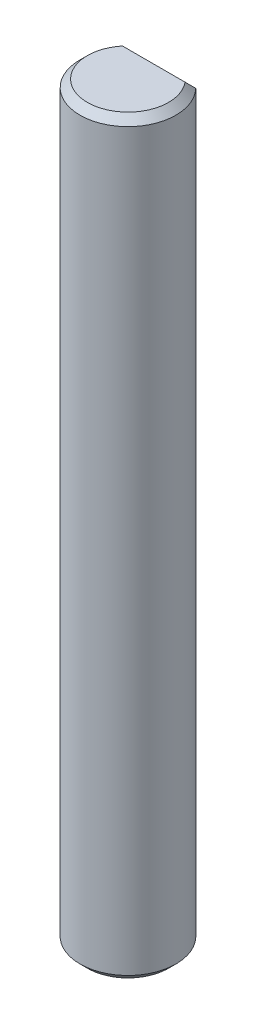
ISO-10303-21;
HEADER;
FILE_DESCRIPTION(('STEP AP214'),'2;1');
FILE_NAME('part.step','',(''),(''),'','','');
FILE_SCHEMA(('AUTOMOTIVE_DESIGN { 1 0 10303 214 1 1 1 1 }'));
ENDSEC;
DATA;
#1=APPLICATION_CONTEXT('core data for automotive mechanical design processes');
#2=APPLICATION_PROTOCOL_DEFINITION('international standard','automotive_design',2000,#1);
#3=PRODUCT_CONTEXT('',#1,'mechanical');
#4=PRODUCT('Part','Part','',(#3));
#5=PRODUCT_RELATED_PRODUCT_CATEGORY('part','',(#4));
#6=PRODUCT_DEFINITION_FORMATION('','',#4);
#7=PRODUCT_DEFINITION_CONTEXT('part definition',#1,'design');
#8=PRODUCT_DEFINITION('design','',#6,#7);
#9=PRODUCT_DEFINITION_SHAPE('','',#8);
#10=(LENGTH_UNIT() NAMED_UNIT(*) SI_UNIT(.MILLI.,.METRE.));
#11=(NAMED_UNIT(*) PLANE_ANGLE_UNIT() SI_UNIT($,.RADIAN.));
#12=(NAMED_UNIT(*) SI_UNIT($,.STERADIAN.) SOLID_ANGLE_UNIT());
#13=UNCERTAINTY_MEASURE_WITH_UNIT(LENGTH_MEASURE(1.E-05),#10,'distance_accuracy_value','');
#14=(GEOMETRIC_REPRESENTATION_CONTEXT(3) GLOBAL_UNCERTAINTY_ASSIGNED_CONTEXT((#13)) GLOBAL_UNIT_ASSIGNED_CONTEXT((#10,
#11,#12)) REPRESENTATION_CONTEXT('',''));
#15=CARTESIAN_POINT('',(0.,0.,0.));
#16=DIRECTION('',(0.,0.,1.));
#17=DIRECTION('',(1.,0.,0.));
#18=AXIS2_PLACEMENT_3D('',#15,#16,#17);
#19=CARTESIAN_POINT('',(0.,25.4,0.));
#20=DIRECTION('',(0.,-1.,0.));
#21=DIRECTION('',(0.,0.,-1.));
#22=AXIS2_PLACEMENT_3D('',#19,#20,#21);
#23=CYLINDRICAL_SURFACE('',#22,3.25);
#24=DIRECTION('',(0.,-1.,0.));
#25=VECTOR('',#24,1.);
#26=CARTESIAN_POINT('',(-2.34520787991172,25.4,-2.25));
#27=LINE('',#26,#25);
#28=CARTESIAN_POINT('',(-2.34520787991172,24.9,-2.25));
#29=VERTEX_POINT('',#28);
#30=CARTESIAN_POINT('',(-2.34520787991172,-24.9,-2.25));
#31=VERTEX_POINT('',#30);
#32=EDGE_CURVE('E91',#29,#31,#27,.T.);
#33=ORIENTED_EDGE('',*,*,#32,.T.);
#34=CARTESIAN_POINT('',(0.,-24.9,0.));
#35=DIRECTION('',(0.,1.,0.));
#36=DIRECTION('',(0.,0.,1.));
#37=AXIS2_PLACEMENT_3D('',#34,#35,#36);
#38=CIRCLE('',#37,3.25);
#39=CARTESIAN_POINT('',(2.34520787991172,-24.9,-2.25));
#40=VERTEX_POINT('',#39);
#41=EDGE_CURVE('E97',#31,#40,#38,.T.);
#42=ORIENTED_EDGE('',*,*,#41,.T.);
#43=DIRECTION('',(0.,-1.,0.));
#44=VECTOR('',#43,1.);
#45=CARTESIAN_POINT('',(2.34520787991172,25.4,-2.25));
#46=LINE('',#45,#44);
#47=CARTESIAN_POINT('',(2.34520787991172,24.9,-2.25));
#48=VERTEX_POINT('',#47);
#49=EDGE_CURVE('E93',#48,#40,#46,.T.);
#50=ORIENTED_EDGE('',*,*,#49,.F.);
#51=CARTESIAN_POINT('',(0.,24.9,0.));
#52=DIRECTION('',(0.,1.,0.));
#53=DIRECTION('',(0.,0.,1.));
#54=AXIS2_PLACEMENT_3D('',#51,#52,#53);
#55=CIRCLE('',#54,3.25);
#56=EDGE_CURVE('E89',#48,#29,#55,.F.);
#57=ORIENTED_EDGE('',*,*,#56,.T.);
#58=EDGE_LOOP('',(#33,#42,#50,#57));
#59=FACE_BOUND('',#58,.T.);
#60=ADVANCED_FACE('F39',(#59),#23,.T.);
#61=CARTESIAN_POINT('',(-2.34520787991172,25.4,-2.25));
#62=DIRECTION('',(0.,0.,1.));
#63=DIRECTION('',(1.,0.,0.));
#64=AXIS2_PLACEMENT_3D('',#61,#62,#63);
#65=PLANE('',#64);
#66=ORIENTED_EDGE('',*,*,#49,.T.);
#67=DIRECTION('',(-1.,0.,0.));
#68=VECTOR('',#67,1.);
#69=CARTESIAN_POINT('',(-2.34520787991172,-24.9,-2.25));
#70=LINE('',#69,#68);
#71=EDGE_CURVE('E105',#40,#31,#70,.T.);
#72=ORIENTED_EDGE('',*,*,#71,.T.);
#73=ORIENTED_EDGE('',*,*,#32,.F.);
#74=DIRECTION('',(1.,0.,0.));
#75=VECTOR('',#74,1.);
#76=CARTESIAN_POINT('',(2.34520787991172,24.9,-2.25));
#77=LINE('',#76,#75);
#78=EDGE_CURVE('E103',#29,#48,#77,.T.);
#79=ORIENTED_EDGE('',*,*,#78,.T.);
#80=EDGE_LOOP('',(#66,#72,#73,#79));
#81=FACE_BOUND('',#80,.T.);
#82=ADVANCED_FACE('F102',(#81),#65,.F.);
#83=CARTESIAN_POINT('',(0.,25.4,0.));
#84=DIRECTION('',(0.,1.,0.));
#85=DIRECTION('',(0.,0.,1.));
#86=AXIS2_PLACEMENT_3D('',#83,#84,#85);
#87=PLANE('',#86);
#88=CARTESIAN_POINT('',(0.,25.4,0.));
#89=DIRECTION('',(0.,1.,0.));
#90=DIRECTION('',(0.,0.,1.));
#91=AXIS2_PLACEMENT_3D('',#88,#89,#90);
#92=CIRCLE('',#91,2.75);
#93=CARTESIAN_POINT('',(-2.12132034355965,25.4,-1.75));
#94=VERTEX_POINT('',#93);
#95=CARTESIAN_POINT('',(2.12132034355965,25.4,-1.75));
#96=VERTEX_POINT('',#95);
#97=EDGE_CURVE('E54',#94,#96,#92,.T.);
#98=ORIENTED_EDGE('',*,*,#97,.T.);
#99=DIRECTION('',(-1.,0.,0.));
#100=VECTOR('',#99,1.);
#101=CARTESIAN_POINT('',(-2.34520787991172,25.4,-1.75));
#102=LINE('',#101,#100);
#103=EDGE_CURVE('E11',#96,#94,#102,.T.);
#104=ORIENTED_EDGE('',*,*,#103,.T.);
#105=EDGE_LOOP('',(#98,#104));
#106=FACE_BOUND('',#105,.T.);
#107=ADVANCED_FACE('F167',(#106),#87,.T.);
#108=CARTESIAN_POINT('',(0.,-25.4,0.));
#109=DIRECTION('',(0.,1.,0.));
#110=DIRECTION('',(0.,0.,1.));
#111=AXIS2_PLACEMENT_3D('',#108,#109,#110);
#112=PLANE('',#111);
#113=CARTESIAN_POINT('',(0.,-25.4,0.));
#114=DIRECTION('',(0.,1.,0.));
#115=DIRECTION('',(0.,0.,1.));
#116=AXIS2_PLACEMENT_3D('',#113,#114,#115);
#117=CIRCLE('',#116,2.75);
#118=CARTESIAN_POINT('',(2.12132034355964,-25.4,-1.74999999999999));
#119=VERTEX_POINT('',#118);
#120=CARTESIAN_POINT('',(-2.12132034355964,-25.4,-1.74999999999999));
#121=VERTEX_POINT('',#120);
#122=EDGE_CURVE('E151',#119,#121,#117,.F.);
#123=ORIENTED_EDGE('',*,*,#122,.T.);
#124=DIRECTION('',(1.,0.,0.));
#125=VECTOR('',#124,1.);
#126=CARTESIAN_POINT('',(0.,-25.4,-1.74999999999999));
#127=LINE('',#126,#125);
#128=EDGE_CURVE('E98',#121,#119,#127,.T.);
#129=ORIENTED_EDGE('',*,*,#128,.T.);
#130=EDGE_LOOP('',(#123,#129));
#131=FACE_BOUND('',#130,.T.);
#132=ADVANCED_FACE('F165',(#131),#112,.F.);
#133=CARTESIAN_POINT('',(0.,-24.9,0.));
#134=DIRECTION('',(0.,1.,0.));
#135=DIRECTION('',(0.,0.,1.));
#136=AXIS2_PLACEMENT_3D('',#133,#134,#135);
#137=CONICAL_SURFACE('',#136,3.25,0.785398163397452);
#138=CARTESIAN_POINT('',(-2.34520787991172,-24.9,-2.25));
#139=CARTESIAN_POINT('',(-2.3273638426593,-24.9418468402449,-2.2081531597551));
#140=CARTESIAN_POINT('',(-2.30933396054444,-24.983654194641,-2.16634580535902));
#141=CARTESIAN_POINT('',(-2.27287766335211,-25.0671799650697,-2.0828200349303));
#142=CARTESIAN_POINT('',(-2.25445126894054,-25.1088983856135,-2.04110161438645));
#143=CARTESIAN_POINT('',(-2.21717505911824,-25.1922411099403,-1.95775889005964));
#144=CARTESIAN_POINT('',(-2.19832523928832,-25.233865412736,-1.91613458726397));
#145=CARTESIAN_POINT('',(-2.16017106135106,-25.3170120879343,-1.83298791206569));
#146=CARTESIAN_POINT('',(-2.14086667965296,-25.3585344549226,-1.79146554507735));
#147=CARTESIAN_POINT('',(-2.12132034355964,-25.4,-1.74999999999999));
#148=B_SPLINE_CURVE_WITH_KNOTS('',3,(#138,#139,#140,#141,#142,#143,#144,#145,#146,#147),
.UNSPECIFIED.,.F.,.F.,(4,2,2,2,4),(0.,0.18543602010277,0.370862398725451,0.556290713500747,
0.741728672899098),.UNSPECIFIED.);
#149=EDGE_CURVE('E114',#121,#31,#148,.F.);
#150=ORIENTED_EDGE('',*,*,#149,.F.);
#151=ORIENTED_EDGE('',*,*,#122,.F.);
#152=CARTESIAN_POINT('',(2.12132034355964,-25.4,-1.74999999999999));
#153=CARTESIAN_POINT('',(2.14086667965296,-25.3585344549226,-1.79146554507735));
#154=CARTESIAN_POINT('',(2.16017106135106,-25.3170120879343,-1.83298791206569));
#155=CARTESIAN_POINT('',(2.19832523928832,-25.233865412736,-1.91613458726397));
#156=CARTESIAN_POINT('',(2.21717505911824,-25.1922411099403,-1.95775889005964));
#157=CARTESIAN_POINT('',(2.25445126894054,-25.1088983856135,-2.04110161438645));
#158=CARTESIAN_POINT('',(2.27287766335211,-25.0671799650697,-2.08282003493029));
#159=CARTESIAN_POINT('',(2.30933396054444,-24.983654194641,-2.16634580535902));
#160=CARTESIAN_POINT('',(2.3273638426593,-24.9418468402449,-2.2081531597551));
#161=CARTESIAN_POINT('',(2.34520787991172,-24.9,-2.25));
#162=B_SPLINE_CURVE_WITH_KNOTS('',3,(#152,#153,#154,#155,#156,#157,#158,#159,#160,#161),
.UNSPECIFIED.,.F.,.F.,(4,2,2,2,4),(0.,0.185437959398352,0.370866274173646,0.55629265279632,
0.741728672899096),.UNSPECIFIED.);
#163=EDGE_CURVE('E107',#40,#119,#162,.F.);
#164=ORIENTED_EDGE('',*,*,#163,.F.);
#165=ORIENTED_EDGE('',*,*,#41,.F.);
#166=EDGE_LOOP('',(#150,#151,#164,#165));
#167=FACE_BOUND('',#166,.T.);
#168=ADVANCED_FACE('F133',(#167),#137,.T.);
#169=CARTESIAN_POINT('',(-2.34520787991172,-24.9,-2.25));
#170=DIRECTION('',(0.,0.70710678118655,0.707106781186545));
#171=DIRECTION('',(-1.,0.,0.));
#172=AXIS2_PLACEMENT_3D('',#169,#170,#171);
#173=PLANE('',#172);
#174=ORIENTED_EDGE('',*,*,#163,.T.);
#175=ORIENTED_EDGE('',*,*,#128,.F.);
#176=ORIENTED_EDGE('',*,*,#149,.T.);
#177=ORIENTED_EDGE('',*,*,#71,.F.);
#178=EDGE_LOOP('',(#174,#175,#176,#177));
#179=FACE_BOUND('',#178,.T.);
#180=ADVANCED_FACE('F129',(#179),#173,.F.);
#181=CARTESIAN_POINT('',(0.,25.4,0.));
#182=DIRECTION('',(0.,-1.,0.));
#183=DIRECTION('',(0.,0.,-1.));
#184=AXIS2_PLACEMENT_3D('',#181,#182,#183);
#185=CONICAL_SURFACE('',#184,2.75,0.785398163397453);
#186=CARTESIAN_POINT('',(-2.12132034355965,25.4,-1.75));
#187=CARTESIAN_POINT('',(-2.14086667965297,25.3585344549226,-1.79146554507736));
#188=CARTESIAN_POINT('',(-2.16017106135106,25.3170120879343,-1.83298791206569));
#189=CARTESIAN_POINT('',(-2.19832523928832,25.233865412736,-1.91613458726398));
#190=CARTESIAN_POINT('',(-2.21717505911824,25.1922411099404,-1.95775889005965));
#191=CARTESIAN_POINT('',(-2.25445126894054,25.1088983856136,-2.04110161438645));
#192=CARTESIAN_POINT('',(-2.27287766335211,25.0671799650697,-2.0828200349303));
#193=CARTESIAN_POINT('',(-2.30933396054444,24.983654194641,-2.16634580535902));
#194=CARTESIAN_POINT('',(-2.3273638426593,24.9418468402449,-2.2081531597551));
#195=CARTESIAN_POINT('',(-2.34520787991172,24.9,-2.25));
#196=B_SPLINE_CURVE_WITH_KNOTS('',3,(#186,#187,#188,#189,#190,#191,#192,#193,#194,#195),
.UNSPECIFIED.,.F.,.F.,(4,2,2,2,4),(0.,0.185437959398348,0.370866274173641,0.556292652796321,
0.741728672899086),.UNSPECIFIED.);
#197=EDGE_CURVE('E67',#29,#94,#196,.F.);
#198=ORIENTED_EDGE('',*,*,#197,.F.);
#199=ORIENTED_EDGE('',*,*,#56,.F.);
#200=CARTESIAN_POINT('',(2.34520787991172,24.9,-2.25));
#201=CARTESIAN_POINT('',(2.3273638426593,24.9418468402449,-2.2081531597551));
#202=CARTESIAN_POINT('',(2.30933396054444,24.983654194641,-2.16634580535902));
#203=CARTESIAN_POINT('',(2.27287766335211,25.0671799650697,-2.0828200349303));
#204=CARTESIAN_POINT('',(2.25445126894054,25.1088983856136,-2.04110161438645));
#205=CARTESIAN_POINT('',(2.21717505911824,25.1922411099404,-1.95775889005965));
#206=CARTESIAN_POINT('',(2.19832523928832,25.233865412736,-1.91613458726398));
#207=CARTESIAN_POINT('',(2.16017106135106,25.3170120879343,-1.83298791206569));
#208=CARTESIAN_POINT('',(2.14086667965297,25.3585344549226,-1.79146554507736));
#209=CARTESIAN_POINT('',(2.12132034355964,25.4,-1.75));
#210=B_SPLINE_CURVE_WITH_KNOTS('',3,(#200,#201,#202,#203,#204,#205,#206,#207,#208,#209),
.UNSPECIFIED.,.F.,.F.,(4,2,2,2,4),(0.,0.18543602010277,0.370862398725446,0.556290713500739,
0.741728672899088),.UNSPECIFIED.);
#211=EDGE_CURVE('E44',#96,#48,#210,.F.);
#212=ORIENTED_EDGE('',*,*,#211,.F.);
#213=ORIENTED_EDGE('',*,*,#97,.F.);
#214=EDGE_LOOP('',(#198,#199,#212,#213));
#215=FACE_BOUND('',#214,.T.);
#216=ADVANCED_FACE('F111',(#215),#185,.T.);
#217=CARTESIAN_POINT('',(0.,25.4,-1.75));
#218=DIRECTION('',(0.,0.707106781186551,-0.707106781186544));
#219=DIRECTION('',(1.,0.,0.));
#220=AXIS2_PLACEMENT_3D('',#217,#218,#219);
#221=PLANE('',#220);
#222=ORIENTED_EDGE('',*,*,#211,.T.);
#223=ORIENTED_EDGE('',*,*,#78,.F.);
#224=ORIENTED_EDGE('',*,*,#197,.T.);
#225=ORIENTED_EDGE('',*,*,#103,.F.);
#226=EDGE_LOOP('',(#222,#223,#224,#225));
#227=FACE_BOUND('',#226,.T.);
#228=ADVANCED_FACE('F41',(#227),#221,.T.);
#229=CLOSED_SHELL('',(#60,#82,#107,#132,#168,#180,#216,#228));
#230=MANIFOLD_SOLID_BREP('B2',#229);
#231=ADVANCED_BREP_SHAPE_REPRESENTATION('',(#18,#230),#14);
#232=SHAPE_DEFINITION_REPRESENTATION(#9,#231);
ENDSEC;
END-ISO-10303-21;
